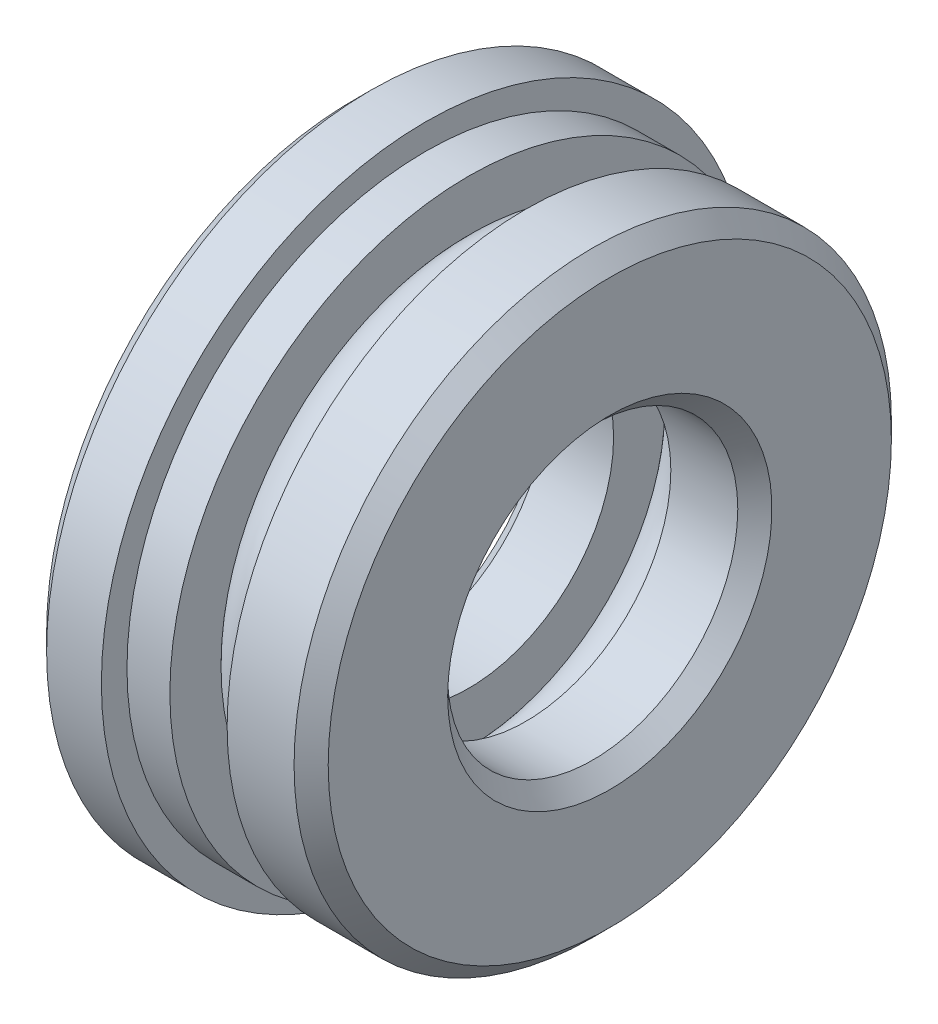
ISO-10303-21;
HEADER;
FILE_DESCRIPTION(('STEP AP214'),'2;1');
FILE_NAME('part.step','',(''),(''),'','','');
FILE_SCHEMA(('AUTOMOTIVE_DESIGN { 1 0 10303 214 1 1 1 1 }'));
ENDSEC;
DATA;
#1=APPLICATION_CONTEXT('core data for automotive mechanical design processes');
#2=APPLICATION_PROTOCOL_DEFINITION('international standard','automotive_design',2000,#1);
#3=PRODUCT_CONTEXT('',#1,'mechanical');
#4=PRODUCT('Part','Part','',(#3));
#5=PRODUCT_RELATED_PRODUCT_CATEGORY('part','',(#4));
#6=PRODUCT_DEFINITION_FORMATION('','',#4);
#7=PRODUCT_DEFINITION_CONTEXT('part definition',#1,'design');
#8=PRODUCT_DEFINITION('design','',#6,#7);
#9=PRODUCT_DEFINITION_SHAPE('','',#8);
#10=(LENGTH_UNIT() NAMED_UNIT(*) SI_UNIT(.MILLI.,.METRE.));
#11=(NAMED_UNIT(*) PLANE_ANGLE_UNIT() SI_UNIT($,.RADIAN.));
#12=(NAMED_UNIT(*) SI_UNIT($,.STERADIAN.) SOLID_ANGLE_UNIT());
#13=UNCERTAINTY_MEASURE_WITH_UNIT(LENGTH_MEASURE(1.E-05),#10,'distance_accuracy_value','');
#14=(GEOMETRIC_REPRESENTATION_CONTEXT(3) GLOBAL_UNCERTAINTY_ASSIGNED_CONTEXT((#13)) GLOBAL_UNIT_ASSIGNED_CONTEXT((#10,
#11,#12)) REPRESENTATION_CONTEXT('',''));
#15=CARTESIAN_POINT('',(0.,0.,0.));
#16=DIRECTION('',(0.,0.,1.));
#17=DIRECTION('',(1.,0.,0.));
#18=AXIS2_PLACEMENT_3D('',#15,#16,#17);
#19=CARTESIAN_POINT('',(8.4,-0.0133040110590031,0.));
#20=DIRECTION('',(-1.,0.,0.));
#21=DIRECTION('',(0.,0.,1.));
#22=AXIS2_PLACEMENT_3D('',#19,#20,#21);
#23=TOROIDAL_SURFACE('',#22,13.,2.25);
#24=CARTESIAN_POINT('',(10.0770509831248,-0.0133040110590031,0.));
#25=DIRECTION('',(-1.,0.,0.));
#26=DIRECTION('',(0.,0.,1.));
#27=AXIS2_PLACEMENT_3D('',#24,#25,#26);
#28=CIRCLE('',#27,11.5);
#29=CARTESIAN_POINT('',(10.0770509831248,-0.0133040110590031,11.5));
#30=VERTEX_POINT('',#29);
#31=EDGE_CURVE('E11',#30,#30,#28,.T.);
#32=ORIENTED_EDGE('',*,*,#31,.F.);
#33=EDGE_LOOP('',(#32));
#34=FACE_BOUND('',#33,.T.);
#35=CARTESIAN_POINT('',(10.0770509831248,-0.0133040110590031,0.));
#36=DIRECTION('',(-1.,0.,0.));
#37=DIRECTION('',(0.,0.,1.));
#38=AXIS2_PLACEMENT_3D('',#35,#36,#37);
#39=CIRCLE('',#38,14.5);
#40=CARTESIAN_POINT('',(10.0770509831248,-0.0133040110590031,14.5));
#41=VERTEX_POINT('',#40);
#42=EDGE_CURVE('E81',#41,#41,#39,.T.);
#43=ORIENTED_EDGE('',*,*,#42,.T.);
#44=EDGE_LOOP('',(#43));
#45=FACE_BOUND('',#44,.T.);
#46=ADVANCED_FACE('F44',(#34,#45),#23,.F.);
#47=CARTESIAN_POINT('',(10.0770509831248,11.486695988941,0.));
#48=DIRECTION('',(1.,0.,0.));
#49=DIRECTION('',(0.,0.,-1.));
#50=AXIS2_PLACEMENT_3D('',#47,#48,#49);
#51=PLANE('',#50);
#52=CARTESIAN_POINT('',(10.0770509831248,-0.0133040110590031,0.));
#53=DIRECTION('',(-1.,0.,0.));
#54=DIRECTION('',(0.,0.,1.));
#55=AXIS2_PLACEMENT_3D('',#52,#53,#54);
#56=CIRCLE('',#55,8.5);
#57=CARTESIAN_POINT('',(10.0770509831248,-0.0133040110590031,8.5));
#58=VERTEX_POINT('',#57);
#59=EDGE_CURVE('E51',#58,#58,#56,.T.);
#60=ORIENTED_EDGE('',*,*,#59,.F.);
#61=EDGE_LOOP('',(#60));
#62=FACE_BOUND('',#61,.T.);
#63=ORIENTED_EDGE('',*,*,#31,.T.);
#64=EDGE_LOOP('',(#63));
#65=FACE_BOUND('',#64,.T.);
#66=ADVANCED_FACE('F119',(#62,#65),#51,.F.);
#67=CARTESIAN_POINT('',(1.80000000000001,-0.0133040110590031,0.));
#68=DIRECTION('',(-1.,0.,0.));
#69=DIRECTION('',(0.,0.,1.));
#70=AXIS2_PLACEMENT_3D('',#67,#68,#69);
#71=CYLINDRICAL_SURFACE('',#70,8.5);
#72=CARTESIAN_POINT('',(14.,-0.0133040110590031,0.));
#73=DIRECTION('',(-1.,0.,0.));
#74=DIRECTION('',(0.,0.,1.));
#75=AXIS2_PLACEMENT_3D('',#72,#73,#74);
#76=CIRCLE('',#75,8.5);
#77=CARTESIAN_POINT('',(14.,-0.0133040110590031,8.5));
#78=VERTEX_POINT('',#77);
#79=EDGE_CURVE('E59',#78,#78,#76,.T.);
#80=ORIENTED_EDGE('',*,*,#79,.F.);
#81=EDGE_LOOP('',(#80));
#82=FACE_BOUND('',#81,.T.);
#83=ORIENTED_EDGE('',*,*,#59,.T.);
#84=EDGE_LOOP('',(#83));
#85=FACE_BOUND('',#84,.T.);
#86=ADVANCED_FACE('F114',(#82,#85),#71,.F.);
#87=CARTESIAN_POINT('',(14.,-0.0133040110590031,0.));
#88=DIRECTION('',(1.,0.,0.));
#89=DIRECTION('',(0.,0.,-1.));
#90=AXIS2_PLACEMENT_3D('',#87,#88,#89);
#91=CONICAL_SURFACE('',#90,8.5,0.785398163397448);
#92=CARTESIAN_POINT('',(15.,-0.0133040110590031,0.));
#93=DIRECTION('',(-1.,0.,0.));
#94=DIRECTION('',(0.,0.,1.));
#95=AXIS2_PLACEMENT_3D('',#92,#93,#94);
#96=CIRCLE('',#95,9.50000000000002);
#97=CARTESIAN_POINT('',(15.,-0.0133040110590031,9.50000000000002));
#98=VERTEX_POINT('',#97);
#99=EDGE_CURVE('E65',#98,#98,#96,.T.);
#100=ORIENTED_EDGE('',*,*,#99,.F.);
#101=EDGE_LOOP('',(#100));
#102=FACE_BOUND('',#101,.T.);
#103=ORIENTED_EDGE('',*,*,#79,.T.);
#104=EDGE_LOOP('',(#103));
#105=FACE_BOUND('',#104,.T.);
#106=ADVANCED_FACE('F108',(#102,#105),#91,.F.);
#107=CARTESIAN_POINT('',(15.,9.48669598894101,0.));
#108=DIRECTION('',(-1.,0.,0.));
#109=DIRECTION('',(0.,0.,1.));
#110=AXIS2_PLACEMENT_3D('',#107,#108,#109);
#111=PLANE('',#110);
#112=CARTESIAN_POINT('',(15.,-0.0133040110590031,0.));
#113=DIRECTION('',(-1.,0.,0.));
#114=DIRECTION('',(0.,0.,1.));
#115=AXIS2_PLACEMENT_3D('',#112,#113,#114);
#116=CIRCLE('',#115,16.5);
#117=CARTESIAN_POINT('',(15.,-0.0133040110590031,16.5));
#118=VERTEX_POINT('',#117);
#119=EDGE_CURVE('E71',#118,#118,#116,.T.);
#120=ORIENTED_EDGE('',*,*,#119,.F.);
#121=EDGE_LOOP('',(#120));
#122=FACE_BOUND('',#121,.T.);
#123=ORIENTED_EDGE('',*,*,#99,.T.);
#124=EDGE_LOOP('',(#123));
#125=FACE_BOUND('',#124,.T.);
#126=ADVANCED_FACE('F102',(#122,#125),#111,.F.);
#127=CARTESIAN_POINT('',(15.,-0.0133040110590031,0.));
#128=DIRECTION('',(-1.,0.,0.));
#129=DIRECTION('',(0.,0.,1.));
#130=AXIS2_PLACEMENT_3D('',#127,#128,#129);
#131=CONICAL_SURFACE('',#130,16.5,0.785398163397445);
#132=CARTESIAN_POINT('',(14.,-0.0133040110590031,0.));
#133=DIRECTION('',(-1.,0.,0.));
#134=DIRECTION('',(0.,0.,1.));
#135=AXIS2_PLACEMENT_3D('',#132,#133,#134);
#136=CIRCLE('',#135,17.5);
#137=CARTESIAN_POINT('',(14.,-0.0133040110590031,17.5));
#138=VERTEX_POINT('',#137);
#139=EDGE_CURVE('E74',#138,#138,#136,.T.);
#140=ORIENTED_EDGE('',*,*,#139,.F.);
#141=EDGE_LOOP('',(#140));
#142=FACE_BOUND('',#141,.T.);
#143=ORIENTED_EDGE('',*,*,#119,.T.);
#144=EDGE_LOOP('',(#143));
#145=FACE_BOUND('',#144,.T.);
#146=ADVANCED_FACE('F96',(#142,#145),#131,.T.);
#147=CARTESIAN_POINT('',(1.80000000000001,-0.0133040110590031,0.));
#148=DIRECTION('',(-1.,0.,0.));
#149=DIRECTION('',(0.,0.,1.));
#150=AXIS2_PLACEMENT_3D('',#147,#148,#149);
#151=CYLINDRICAL_SURFACE('',#150,17.5);
#152=CARTESIAN_POINT('',(10.0770509831248,-0.0133040110590031,0.));
#153=DIRECTION('',(-1.,0.,0.));
#154=DIRECTION('',(0.,0.,1.));
#155=AXIS2_PLACEMENT_3D('',#152,#153,#154);
#156=CIRCLE('',#155,17.5);
#157=CARTESIAN_POINT('',(10.0770509831248,-0.0133040110590031,17.5));
#158=VERTEX_POINT('',#157);
#159=EDGE_CURVE('E77',#158,#158,#156,.T.);
#160=ORIENTED_EDGE('',*,*,#159,.F.);
#161=EDGE_LOOP('',(#160));
#162=FACE_BOUND('',#161,.T.);
#163=ORIENTED_EDGE('',*,*,#139,.T.);
#164=EDGE_LOOP('',(#163));
#165=FACE_BOUND('',#164,.T.);
#166=ADVANCED_FACE('F90',(#162,#165),#151,.T.);
#167=CARTESIAN_POINT('',(10.0770509831248,14.486695988941,0.));
#168=DIRECTION('',(1.,0.,0.));
#169=DIRECTION('',(0.,0.,-1.));
#170=AXIS2_PLACEMENT_3D('',#167,#168,#169);
#171=PLANE('',#170);
#172=ORIENTED_EDGE('',*,*,#42,.F.);
#173=EDGE_LOOP('',(#172));
#174=FACE_BOUND('',#173,.T.);
#175=ORIENTED_EDGE('',*,*,#159,.T.);
#176=EDGE_LOOP('',(#175));
#177=FACE_BOUND('',#176,.T.);
#178=ADVANCED_FACE('F87',(#174,#177),#171,.F.);
#179=CLOSED_SHELL('',(#46,#66,#86,#106,#126,#146,#166,#178));
#180=MANIFOLD_SOLID_BREP('B2',#179);
#181=CARTESIAN_POINT('',(8.4,-0.0133040110590031,0.));
#182=DIRECTION('',(-1.,0.,0.));
#183=DIRECTION('',(0.,0.,1.));
#184=AXIS2_PLACEMENT_3D('',#181,#182,#183);
#185=TOROIDAL_SURFACE('',#184,13.,2.25);
#186=CARTESIAN_POINT('',(8.4,-0.0133040110590031,15.25));
#187=VERTEX_POINT('',#186);
#188=VERTEX_LOOP('',#187);
#189=FACE_BOUND('',#188,.T.);
#190=ADVANCED_FACE('F194',(#189),#185,.T.);
#191=CLOSED_SHELL('',(#190));
#192=MANIFOLD_SOLID_BREP('B6',#191);
#193=CARTESIAN_POINT('',(31.,-0.0133040110590031,0.));
#194=DIRECTION('',(-1.,0.,0.));
#195=DIRECTION('',(0.,1.,0.));
#196=AXIS2_PLACEMENT_3D('',#193,#194,#195);
#197=SPHERICAL_SURFACE('',#196,32.);
#198=CARTESIAN_POINT('',(1.80000000000001,-0.0133040110590031,0.));
#199=DIRECTION('',(-1.,0.,0.));
#200=DIRECTION('',(0.,0.,1.));
#201=AXIS2_PLACEMENT_3D('',#198,#199,#200);
#202=CIRCLE('',#201,13.0904545375629);
#203=CARTESIAN_POINT('',(1.80000000000001,13.0771505265039,0.));
#204=VERTEX_POINT('',#203);
#205=EDGE_CURVE('E193',#204,#204,#202,.T.);
#206=CARTESIAN_POINT('',(4.20914335076239,-0.0133040110590031,0.));
#207=DIRECTION('',(-1.,0.,0.));
#208=DIRECTION('',(0.,0.,1.));
#209=AXIS2_PLACEMENT_3D('',#206,#207,#208);
#210=CIRCLE('',#209,17.5);
#211=CARTESIAN_POINT('',(4.20914335076239,17.486695988941,0.));
#212=VERTEX_POINT('',#211);
#213=EDGE_CURVE('E245',#212,#212,#210,.T.);
#214=CARTESIAN_POINT('',(1.80000000000001,13.0771505265039,0.));
#215=CARTESIAN_POINT('',(1.8214335796401,13.124960979485,0.));
#216=CARTESIAN_POINT('',(1.84298458452997,13.1727187903362,0.));
#217=CARTESIAN_POINT('',(1.88632092036724,13.2681279775024,0.));
#218=CARTESIAN_POINT('',(1.90810625131463,13.3157793538175,0.));
#219=CARTESIAN_POINT('',(1.95191071482488,13.4109745216357,0.));
#220=CARTESIAN_POINT('',(1.97392984738773,13.4585183131388,0.));
#221=CARTESIAN_POINT('',(2.01820138253074,13.5534971643409,0.));
#222=CARTESIAN_POINT('',(2.0404537851109,13.60093222404,0.));
#223=CARTESIAN_POINT('',(2.08519132346794,13.6956924670813,0.));
#224=CARTESIAN_POINT('',(2.10767645924481,13.7430176504234,0.));
#225=CARTESIAN_POINT('',(2.15287892145055,13.8375569988984,0.));
#226=CARTESIAN_POINT('',(2.1755962478794,13.8847711640312,0.));
#227=CARTESIAN_POINT('',(2.22126254327121,13.9790873369005,0.));
#228=CARTESIAN_POINT('',(2.24421151223416,14.0261893446369,0.));
#229=CARTESIAN_POINT('',(2.29034053897936,14.1202800662361,0.));
#230=CARTESIAN_POINT('',(2.31352059676162,14.1672687800989,0.));
#231=CARTESIAN_POINT('',(2.36011124185704,14.261131780206,0.));
#232=CARTESIAN_POINT('',(2.38352182917021,14.3080060664504,0.));
#233=CARTESIAN_POINT('',(2.43057296847626,14.4016390803371,0.));
#234=CARTESIAN_POINT('',(2.45421352046915,14.4483978079796,0.));
#235=CARTESIAN_POINT('',(2.50172401873504,14.541798576467,0.));
#236=CARTESIAN_POINT('',(2.52559396500803,14.588440617312,0.));
#237=CARTESIAN_POINT('',(2.57356267589963,14.6816068868248,0.));
#238=CARTESIAN_POINT('',(2.59766144051824,14.7281311154924,0.));
#239=CARTESIAN_POINT('',(2.64608720664564,14.821060638113,0.));
#240=CARTESIAN_POINT('',(2.67041420815444,14.867465932066,0.));
#241=CARTESIAN_POINT('',(2.7192958610999,14.9601564655893,0.));
#242=CARTESIAN_POINT('',(2.74385051253657,15.0064417051597,0.));
#243=CARTESIAN_POINT('',(2.79318687288271,15.0988910131469,0.));
#244=CARTESIAN_POINT('',(2.81796858179219,15.1450550815637,0.));
#245=CARTESIAN_POINT('',(2.86775845915044,15.2372609333963,0.));
#246=CARTESIAN_POINT('',(2.89276662759921,15.283302716812,0.));
#247=CARTESIAN_POINT('',(2.94300882063853,15.3752628877455,0.));
#248=CARTESIAN_POINT('',(2.96824284522908,15.4211812752633,0.));
#249=CARTESIAN_POINT('',(3.01893614170494,15.5128935464811,0.));
#250=CARTESIAN_POINT('',(3.04439541359026,15.5586874301811,0.));
#251=CARTESIAN_POINT('',(3.09553859037392,15.6501495888479,0.));
#252=CARTESIAN_POINT('',(3.12122249527226,15.6958178638147,0.));
#253=CARTESIAN_POINT('',(3.17281431838023,15.7870277031299,0.));
#254=CARTESIAN_POINT('',(3.19872223658987,15.8325692674784,0.));
#255=CARTESIAN_POINT('',(3.25076146121376,15.9235245867295,0.));
#256=CARTESIAN_POINT('',(3.276892767628,15.9689383416321,0.));
#257=CARTESIAN_POINT('',(3.32937813816446,16.0596369462474,0.));
#258=CARTESIAN_POINT('',(3.35573220228667,16.1049217959602,0.));
#259=CARTESIAN_POINT('',(3.40866245236776,16.1953614975622,0.));
#260=CARTESIAN_POINT('',(3.43523863832663,16.2405163494516,0.));
#261=CARTESIAN_POINT('',(3.48861249085032,16.3306949659097,0.));
#262=CARTESIAN_POINT('',(3.51541015741514,16.3757187304785,0.));
#263=CARTESIAN_POINT('',(3.56922632457626,16.4656340859613,0.));
#264=CARTESIAN_POINT('',(3.59624482517256,16.5105256768753,0.));
#265=CARTESIAN_POINT('',(3.65050200849337,16.6001756019038,0.));
#266=CARTESIAN_POINT('',(3.67774069121789,16.6449339360183,0.));
#267=CARTESIAN_POINT('',(3.73243758158123,16.7343162675167,0.));
#268=CARTESIAN_POINT('',(3.75989578922007,16.7789402649007,0.));
#269=CARTESIAN_POINT('',(3.81503106689425,16.8680528462532,0.));
#270=CARTESIAN_POINT('',(3.84270813692961,16.9125414302218,0.));
#271=CARTESIAN_POINT('',(3.89828047162521,17.0013821113086,0.));
#272=CARTESIAN_POINT('',(3.92617573628545,17.0457342084268,0.));
#273=CARTESIAN_POINT('',(3.98218378709425,17.1343008457357,0.));
#274=CARTESIAN_POINT('',(4.01029657324282,17.1785153859264,0.));
#275=CARTESIAN_POINT('',(4.06673898901778,17.2668058423803,0.));
#276=CARTESIAN_POINT('',(4.09506861864419,17.3108817586435,0.));
#277=CARTESIAN_POINT('',(4.15194403673487,17.3988939044901,0.));
#278=CARTESIAN_POINT('',(4.18048982519915,17.4428301340736,0.));
#279=CARTESIAN_POINT('',(4.20914335076239,17.486695988941,0.));
#280=B_SPLINE_CURVE_WITH_KNOTS('',3,(#214,#215,#216,#217,#218,#219,#220,#221,#222,#223,#224,
#225,#226,#227,#228,#229,#230,#231,#232,#233,#234,#235,#236,#237,#238,#239,#240,#241,#242,#243,
#244,#245,#246,#247,#248,#249,#250,#251,#252,#253,#254,#255,#256,#257,#258,#259,#260,#261,#262,
#263,#264,#265,#266,#267,#268,#269,#270,#271,#272,#273,#274,#275,#276,#277,#278,#279),
.UNSPECIFIED.,.F.,.F.,(4,2,2,2,2,2,2,2,2,2,2,2,2,2,2,2,2,2,2,2,2,2,2,2,2,2,2,2,2,2,2,2,4),(0.,
0.157184891357785,0.314369782715567,0.471554674073345,0.628739565431128,0.785924456788912,
0.943109348146689,1.10029423950447,1.25747913086226,1.41466402222004,1.57184891357782,
1.7290338049356,1.88621869629339,2.04340358765117,2.20058847900894,2.35777337036673,
2.51495826172451,2.67214315308229,2.82932804444008,2.98651293579786,3.14369782715564,
3.30088271851342,3.4580676098712,3.61525250122898,3.77243739258677,3.92962228394455,
4.08680717530233,4.24399206666011,4.40117695801789,4.55836184937568,4.71554674073345,
4.87273163209124,5.02991652344902),.UNSPECIFIED.);
#281=EDGE_CURVE('BSEAM214',#204,#212,#280,.T.);
#282=ORIENTED_EDGE('',*,*,#205,.F.);
#283=ORIENTED_EDGE('',*,*,#213,.T.);
#284=ORIENTED_EDGE('',*,*,#281,.T.);
#285=ORIENTED_EDGE('',*,*,#281,.F.);
#286=EDGE_LOOP('',(#282,#284,#283,#285));
#287=FACE_BOUND('',#286,.T.);
#288=ADVANCED_FACE('F214',(#287),#197,.T.);
#289=CARTESIAN_POINT('',(1.80000000000001,9.48669598894099,0.));
#290=DIRECTION('',(1.,0.,0.));
#291=DIRECTION('',(0.,0.,-1.));
#292=AXIS2_PLACEMENT_3D('',#289,#290,#291);
#293=PLANE('',#292);
#294=CARTESIAN_POINT('',(1.80000000000001,-0.0133040110590031,0.));
#295=DIRECTION('',(-1.,0.,0.));
#296=DIRECTION('',(0.,0.,1.));
#297=AXIS2_PLACEMENT_3D('',#294,#295,#296);
#298=CIRCLE('',#297,9.49999999999999);
#299=CARTESIAN_POINT('',(1.80000000000001,-0.0133040110590031,9.49999999999999));
#300=VERTEX_POINT('',#299);
#301=EDGE_CURVE('E220',#300,#300,#298,.T.);
#302=ORIENTED_EDGE('',*,*,#301,.F.);
#303=EDGE_LOOP('',(#302));
#304=FACE_BOUND('',#303,.T.);
#305=ORIENTED_EDGE('',*,*,#205,.T.);
#306=EDGE_LOOP('',(#305));
#307=FACE_BOUND('',#306,.T.);
#308=ADVANCED_FACE('F284',(#304,#307),#293,.F.);
#309=CARTESIAN_POINT('',(1.80000000000001,-0.0133040110590031,0.));
#310=DIRECTION('',(-1.,0.,0.));
#311=DIRECTION('',(0.,0.,1.));
#312=AXIS2_PLACEMENT_3D('',#309,#310,#311);
#313=CONICAL_SURFACE('',#312,9.49999999999999,0.785398163397448);
#314=CARTESIAN_POINT('',(2.8,-0.0133040110590031,0.));
#315=DIRECTION('',(-1.,0.,0.));
#316=DIRECTION('',(0.,0.,1.));
#317=AXIS2_PLACEMENT_3D('',#314,#315,#316);
#318=CIRCLE('',#317,8.5);
#319=CARTESIAN_POINT('',(2.8,-0.0133040110590031,8.5));
#320=VERTEX_POINT('',#319);
#321=EDGE_CURVE('E224',#320,#320,#318,.T.);
#322=ORIENTED_EDGE('',*,*,#321,.F.);
#323=EDGE_LOOP('',(#322));
#324=FACE_BOUND('',#323,.T.);
#325=ORIENTED_EDGE('',*,*,#301,.T.);
#326=EDGE_LOOP('',(#325));
#327=FACE_BOUND('',#326,.T.);
#328=ADVANCED_FACE('F279',(#324,#327),#313,.F.);
#329=CARTESIAN_POINT('',(1.80000000000001,-0.0133040110590031,0.));
#330=DIRECTION('',(-1.,0.,0.));
#331=DIRECTION('',(0.,0.,1.));
#332=AXIS2_PLACEMENT_3D('',#329,#330,#331);
#333=CYLINDRICAL_SURFACE('',#332,8.5);
#334=CARTESIAN_POINT('',(6.72294901687516,-0.0133040110590031,0.));
#335=DIRECTION('',(-1.,0.,0.));
#336=DIRECTION('',(0.,0.,1.));
#337=AXIS2_PLACEMENT_3D('',#334,#335,#336);
#338=CIRCLE('',#337,8.5);
#339=CARTESIAN_POINT('',(6.72294901687516,-0.0133040110590031,8.5));
#340=VERTEX_POINT('',#339);
#341=EDGE_CURVE('E229',#340,#340,#338,.T.);
#342=ORIENTED_EDGE('',*,*,#341,.F.);
#343=EDGE_LOOP('',(#342));
#344=FACE_BOUND('',#343,.T.);
#345=ORIENTED_EDGE('',*,*,#321,.T.);
#346=EDGE_LOOP('',(#345));
#347=FACE_BOUND('',#346,.T.);
#348=ADVANCED_FACE('F273',(#344,#347),#333,.F.);
#349=CARTESIAN_POINT('',(6.72294901687516,11.486695988941,0.));
#350=DIRECTION('',(-1.,0.,0.));
#351=DIRECTION('',(0.,0.,1.));
#352=AXIS2_PLACEMENT_3D('',#349,#350,#351);
#353=PLANE('',#352);
#354=CARTESIAN_POINT('',(6.72294901687516,-0.0133040110590031,0.));
#355=DIRECTION('',(-1.,0.,0.));
#356=DIRECTION('',(0.,0.,1.));
#357=AXIS2_PLACEMENT_3D('',#354,#355,#356);
#358=CIRCLE('',#357,11.5);
#359=CARTESIAN_POINT('',(6.72294901687516,-0.0133040110590031,11.5));
#360=VERTEX_POINT('',#359);
#361=EDGE_CURVE('E234',#360,#360,#358,.T.);
#362=ORIENTED_EDGE('',*,*,#361,.F.);
#363=EDGE_LOOP('',(#362));
#364=FACE_BOUND('',#363,.T.);
#365=ORIENTED_EDGE('',*,*,#341,.T.);
#366=EDGE_LOOP('',(#365));
#367=FACE_BOUND('',#366,.T.);
#368=ADVANCED_FACE('F267',(#364,#367),#353,.F.);
#369=CARTESIAN_POINT('',(8.4,-0.0133040110590031,0.));
#370=DIRECTION('',(-1.,0.,0.));
#371=DIRECTION('',(0.,0.,1.));
#372=AXIS2_PLACEMENT_3D('',#369,#370,#371);
#373=TOROIDAL_SURFACE('',#372,13.,2.25);
#374=CARTESIAN_POINT('',(6.72294901687516,-0.0133040110590031,0.));
#375=DIRECTION('',(-1.,0.,0.));
#376=DIRECTION('',(0.,0.,1.));
#377=AXIS2_PLACEMENT_3D('',#374,#375,#376);
#378=CIRCLE('',#377,14.5);
#379=CARTESIAN_POINT('',(6.72294901687516,-0.0133040110590031,14.5));
#380=VERTEX_POINT('',#379);
#381=EDGE_CURVE('E238',#380,#380,#378,.T.);
#382=ORIENTED_EDGE('',*,*,#381,.F.);
#383=EDGE_LOOP('',(#382));
#384=FACE_BOUND('',#383,.T.);
#385=ORIENTED_EDGE('',*,*,#361,.T.);
#386=EDGE_LOOP('',(#385));
#387=FACE_BOUND('',#386,.T.);
#388=ADVANCED_FACE('F261',(#384,#387),#373,.F.);
#389=CARTESIAN_POINT('',(6.72294901687516,14.486695988941,0.));
#390=DIRECTION('',(-1.,0.,0.));
#391=DIRECTION('',(0.,0.,1.));
#392=AXIS2_PLACEMENT_3D('',#389,#390,#391);
#393=PLANE('',#392);
#394=CARTESIAN_POINT('',(6.72294901687516,-0.0133040110590031,0.));
#395=DIRECTION('',(-1.,0.,0.));
#396=DIRECTION('',(0.,0.,1.));
#397=AXIS2_PLACEMENT_3D('',#394,#395,#396);
#398=CIRCLE('',#397,17.5);
#399=CARTESIAN_POINT('',(6.72294901687516,-0.0133040110590031,17.5));
#400=VERTEX_POINT('',#399);
#401=EDGE_CURVE('E241',#400,#400,#398,.T.);
#402=ORIENTED_EDGE('',*,*,#401,.F.);
#403=EDGE_LOOP('',(#402));
#404=FACE_BOUND('',#403,.T.);
#405=ORIENTED_EDGE('',*,*,#381,.T.);
#406=EDGE_LOOP('',(#405));
#407=FACE_BOUND('',#406,.T.);
#408=ADVANCED_FACE('F255',(#404,#407),#393,.F.);
#409=CARTESIAN_POINT('',(1.80000000000001,-0.0133040110590031,0.));
#410=DIRECTION('',(-1.,0.,0.));
#411=DIRECTION('',(0.,0.,1.));
#412=AXIS2_PLACEMENT_3D('',#409,#410,#411);
#413=CYLINDRICAL_SURFACE('',#412,17.5);
#414=ORIENTED_EDGE('',*,*,#213,.F.);
#415=EDGE_LOOP('',(#414));
#416=FACE_BOUND('',#415,.T.);
#417=ORIENTED_EDGE('',*,*,#401,.T.);
#418=EDGE_LOOP('',(#417));
#419=FACE_BOUND('',#418,.T.);
#420=ADVANCED_FACE('F252',(#416,#419),#413,.T.);
#421=CLOSED_SHELL('',(#288,#308,#328,#348,#368,#388,#408,#420));
#422=MANIFOLD_SOLID_BREP('B40',#421);
#423=CARTESIAN_POINT('',(31.,-0.0133040110590031,0.));
#424=DIRECTION('',(-1.,0.,0.));
#425=DIRECTION('',(0.,1.,0.));
#426=AXIS2_PLACEMENT_3D('',#423,#424,#425);
#427=SPHERICAL_SURFACE('',#426,32.);
#428=CARTESIAN_POINT('',(4.20914335076239,-0.0133040110590031,0.));
#429=DIRECTION('',(-1.,0.,0.));
#430=DIRECTION('',(0.,0.,1.));
#431=AXIS2_PLACEMENT_3D('',#428,#429,#430);
#432=CIRCLE('',#431,17.5);
#433=CARTESIAN_POINT('',(4.20914335076239,17.486695988941,0.));
#434=VERTEX_POINT('',#433);
#435=EDGE_CURVE('E213',#434,#434,#432,.T.);
#436=CARTESIAN_POINT('',(1.80000000000001,-0.0133040110590031,0.));
#437=DIRECTION('',(-1.,0.,0.));
#438=DIRECTION('',(0.,0.,1.));
#439=AXIS2_PLACEMENT_3D('',#436,#437,#438);
#440=CIRCLE('',#439,13.0904545375629);
#441=CARTESIAN_POINT('',(1.80000000000001,13.0771505265039,0.));
#442=VERTEX_POINT('',#441);
#443=EDGE_CURVE('E372',#442,#442,#440,.T.);
#444=CARTESIAN_POINT('',(4.20914335076239,17.486695988941,0.));
#445=CARTESIAN_POINT('',(4.18048982519915,17.4428301340736,0.));
#446=CARTESIAN_POINT('',(4.15194403673487,17.3988939044901,0.));
#447=CARTESIAN_POINT('',(4.09506861864419,17.3108817586435,0.));
#448=CARTESIAN_POINT('',(4.06673898901778,17.2668058423803,0.));
#449=CARTESIAN_POINT('',(4.01029657324282,17.1785153859264,0.));
#450=CARTESIAN_POINT('',(3.98218378709425,17.1343008457357,0.));
#451=CARTESIAN_POINT('',(3.92617573628545,17.0457342084268,0.));
#452=CARTESIAN_POINT('',(3.89828047162521,17.0013821113086,0.));
#453=CARTESIAN_POINT('',(3.84270813692961,16.9125414302218,0.));
#454=CARTESIAN_POINT('',(3.81503106689425,16.8680528462532,0.));
#455=CARTESIAN_POINT('',(3.75989578922007,16.7789402649007,0.));
#456=CARTESIAN_POINT('',(3.73243758158123,16.7343162675167,0.));
#457=CARTESIAN_POINT('',(3.67774069121789,16.6449339360183,0.));
#458=CARTESIAN_POINT('',(3.65050200849337,16.6001756019038,0.));
#459=CARTESIAN_POINT('',(3.59624482517256,16.5105256768753,0.));
#460=CARTESIAN_POINT('',(3.56922632457626,16.4656340859613,0.));
#461=CARTESIAN_POINT('',(3.51541015741514,16.3757187304785,0.));
#462=CARTESIAN_POINT('',(3.48861249085032,16.3306949659097,0.));
#463=CARTESIAN_POINT('',(3.43523863832663,16.2405163494516,0.));
#464=CARTESIAN_POINT('',(3.40866245236776,16.1953614975622,0.));
#465=CARTESIAN_POINT('',(3.35573220228667,16.1049217959602,0.));
#466=CARTESIAN_POINT('',(3.32937813816446,16.0596369462474,0.));
#467=CARTESIAN_POINT('',(3.276892767628,15.9689383416321,0.));
#468=CARTESIAN_POINT('',(3.25076146121376,15.9235245867295,0.));
#469=CARTESIAN_POINT('',(3.19872223658987,15.8325692674784,0.));
#470=CARTESIAN_POINT('',(3.17281431838023,15.7870277031299,0.));
#471=CARTESIAN_POINT('',(3.12122249527226,15.6958178638147,0.));
#472=CARTESIAN_POINT('',(3.09553859037392,15.6501495888479,0.));
#473=CARTESIAN_POINT('',(3.04439541359026,15.5586874301811,0.));
#474=CARTESIAN_POINT('',(3.01893614170494,15.5128935464811,0.));
#475=CARTESIAN_POINT('',(2.96824284522908,15.4211812752633,0.));
#476=CARTESIAN_POINT('',(2.94300882063853,15.3752628877455,0.));
#477=CARTESIAN_POINT('',(2.89276662759921,15.283302716812,0.));
#478=CARTESIAN_POINT('',(2.86775845915044,15.2372609333963,0.));
#479=CARTESIAN_POINT('',(2.81796858179219,15.1450550815637,0.));
#480=CARTESIAN_POINT('',(2.79318687288271,15.0988910131469,0.));
#481=CARTESIAN_POINT('',(2.74385051253657,15.0064417051597,0.));
#482=CARTESIAN_POINT('',(2.7192958610999,14.9601564655893,0.));
#483=CARTESIAN_POINT('',(2.67041420815444,14.867465932066,0.));
#484=CARTESIAN_POINT('',(2.64608720664564,14.821060638113,0.));
#485=CARTESIAN_POINT('',(2.59766144051824,14.7281311154924,0.));
#486=CARTESIAN_POINT('',(2.57356267589963,14.6816068868248,0.));
#487=CARTESIAN_POINT('',(2.52559396500803,14.588440617312,0.));
#488=CARTESIAN_POINT('',(2.50172401873504,14.541798576467,0.));
#489=CARTESIAN_POINT('',(2.45421352046915,14.4483978079796,0.));
#490=CARTESIAN_POINT('',(2.43057296847626,14.4016390803371,0.));
#491=CARTESIAN_POINT('',(2.3835218291702,14.3080060664504,0.));
#492=CARTESIAN_POINT('',(2.36011124185704,14.261131780206,0.));
#493=CARTESIAN_POINT('',(2.31352059676162,14.1672687800989,0.));
#494=CARTESIAN_POINT('',(2.29034053897936,14.1202800662361,0.));
#495=CARTESIAN_POINT('',(2.24421151223416,14.0261893446369,0.));
#496=CARTESIAN_POINT('',(2.22126254327121,13.9790873369005,0.));
#497=CARTESIAN_POINT('',(2.1755962478794,13.8847711640312,0.));
#498=CARTESIAN_POINT('',(2.15287892145055,13.8375569988984,0.));
#499=CARTESIAN_POINT('',(2.10767645924481,13.7430176504234,0.));
#500=CARTESIAN_POINT('',(2.08519132346794,13.6956924670813,0.));
#501=CARTESIAN_POINT('',(2.0404537851109,13.60093222404,0.));
#502=CARTESIAN_POINT('',(2.01820138253074,13.5534971643409,0.));
#503=CARTESIAN_POINT('',(1.97392984738773,13.4585183131388,0.));
#504=CARTESIAN_POINT('',(1.95191071482488,13.4109745216357,0.));
#505=CARTESIAN_POINT('',(1.90810625131463,13.3157793538175,0.));
#506=CARTESIAN_POINT('',(1.88632092036724,13.2681279775024,0.));
#507=CARTESIAN_POINT('',(1.84298458452997,13.1727187903362,0.));
#508=CARTESIAN_POINT('',(1.8214335796401,13.124960979485,0.));
#509=CARTESIAN_POINT('',(1.80000000000001,13.0771505265039,0.));
#510=B_SPLINE_CURVE_WITH_KNOTS('',3,(#444,#445,#446,#447,#448,#449,#450,#451,#452,#453,#454,
#455,#456,#457,#458,#459,#460,#461,#462,#463,#464,#465,#466,#467,#468,#469,#470,#471,#472,#473,
#474,#475,#476,#477,#478,#479,#480,#481,#482,#483,#484,#485,#486,#487,#488,#489,#490,#491,#492,
#493,#494,#495,#496,#497,#498,#499,#500,#501,#502,#503,#504,#505,#506,#507,#508,#509),
.UNSPECIFIED.,.F.,.F.,(4,2,2,2,2,2,2,2,2,2,2,2,2,2,2,2,2,2,2,2,2,2,2,2,2,2,2,2,2,2,2,2,4),(0.,
0.157184891357782,0.314369782715568,0.471554674073344,0.628739565431127,0.785924456788909,
0.943109348146686,1.10029423950447,1.25747913086225,1.41466402222004,1.57184891357782,
1.7290338049356,1.88621869629338,2.04340358765116,2.20058847900894,2.35777337036672,
2.51495826172451,2.67214315308229,2.82932804444008,2.98651293579785,3.14369782715563,
3.30088271851342,3.4580676098712,3.61525250122898,3.77243739258676,3.92962228394455,
4.08680717530233,4.24399206666011,4.40117695801789,4.55836184937567,4.71554674073345,
4.87273163209123,5.02991652344902),.UNSPECIFIED.);
#511=EDGE_CURVE('BSEAM344',#434,#442,#510,.T.);
#512=ORIENTED_EDGE('',*,*,#435,.F.);
#513=ORIENTED_EDGE('',*,*,#443,.T.);
#514=ORIENTED_EDGE('',*,*,#511,.T.);
#515=ORIENTED_EDGE('',*,*,#511,.F.);
#516=EDGE_LOOP('',(#512,#514,#513,#515));
#517=FACE_BOUND('',#516,.T.);
#518=ADVANCED_FACE('F344',(#517),#427,.F.);
#519=CARTESIAN_POINT('',(4.20914335076239,17.486695988941,0.));
#520=DIRECTION('',(-1.,0.,0.));
#521=DIRECTION('',(0.,0.,1.));
#522=AXIS2_PLACEMENT_3D('',#519,#520,#521);
#523=PLANE('',#522);
#524=CARTESIAN_POINT('',(4.20914335076239,-0.0133040110590031,0.));
#525=DIRECTION('',(-1.,0.,0.));
#526=DIRECTION('',(0.,0.,1.));
#527=AXIS2_PLACEMENT_3D('',#524,#525,#526);
#528=CIRCLE('',#527,19.);
#529=CARTESIAN_POINT('',(4.20914335076239,-0.0133040110590031,19.));
#530=VERTEX_POINT('',#529);
#531=EDGE_CURVE('E351',#530,#530,#528,.T.);
#532=ORIENTED_EDGE('',*,*,#531,.F.);
#533=EDGE_LOOP('',(#532));
#534=FACE_BOUND('',#533,.T.);
#535=ORIENTED_EDGE('',*,*,#435,.T.);
#536=EDGE_LOOP('',(#535));
#537=FACE_BOUND('',#536,.T.);
#538=ADVANCED_FACE('F397',(#534,#537),#523,.F.);
#539=CARTESIAN_POINT('',(1.80000000000001,-0.0133040110590031,0.));
#540=DIRECTION('',(-1.,0.,0.));
#541=DIRECTION('',(0.,0.,1.));
#542=AXIS2_PLACEMENT_3D('',#539,#540,#541);
#543=CYLINDRICAL_SURFACE('',#542,19.);
#544=CARTESIAN_POINT('',(1.,-0.0133040110590031,0.));
#545=DIRECTION('',(-1.,0.,0.));
#546=DIRECTION('',(0.,0.,1.));
#547=AXIS2_PLACEMENT_3D('',#544,#545,#546);
#548=CIRCLE('',#547,19.);
#549=CARTESIAN_POINT('',(1.,-0.0133040110590031,19.));
#550=VERTEX_POINT('',#549);
#551=EDGE_CURVE('E358',#550,#550,#548,.T.);
#552=ORIENTED_EDGE('',*,*,#551,.F.);
#553=EDGE_LOOP('',(#552));
#554=FACE_BOUND('',#553,.T.);
#555=ORIENTED_EDGE('',*,*,#531,.T.);
#556=EDGE_LOOP('',(#555));
#557=FACE_BOUND('',#556,.T.);
#558=ADVANCED_FACE('F392',(#554,#557),#543,.T.);
#559=CARTESIAN_POINT('',(1.,-0.0133040110590031,0.));
#560=DIRECTION('',(1.,0.,0.));
#561=DIRECTION('',(0.,0.,-1.));
#562=AXIS2_PLACEMENT_3D('',#559,#560,#561);
#563=CONICAL_SURFACE('',#562,19.,0.785398163397448);
#564=CARTESIAN_POINT('',(0.,-0.0133040110590031,0.));
#565=DIRECTION('',(-1.,0.,0.));
#566=DIRECTION('',(0.,0.,1.));
#567=AXIS2_PLACEMENT_3D('',#564,#565,#566);
#568=CIRCLE('',#567,18.);
#569=CARTESIAN_POINT('',(0.,-0.0133040110590031,18.));
#570=VERTEX_POINT('',#569);
#571=EDGE_CURVE('E364',#570,#570,#568,.T.);
#572=ORIENTED_EDGE('',*,*,#571,.F.);
#573=EDGE_LOOP('',(#572));
#574=FACE_BOUND('',#573,.T.);
#575=ORIENTED_EDGE('',*,*,#551,.T.);
#576=EDGE_LOOP('',(#575));
#577=FACE_BOUND('',#576,.T.);
#578=ADVANCED_FACE('F386',(#574,#577),#563,.T.);
#579=CARTESIAN_POINT('',(0.,17.986695988941,0.));
#580=DIRECTION('',(1.,0.,0.));
#581=DIRECTION('',(0.,0.,-1.));
#582=AXIS2_PLACEMENT_3D('',#579,#580,#581);
#583=PLANE('',#582);
#584=CARTESIAN_POINT('',(0.,-0.0133040110590031,0.));
#585=DIRECTION('',(-1.,0.,0.));
#586=DIRECTION('',(0.,0.,1.));
#587=AXIS2_PLACEMENT_3D('',#584,#585,#586);
#588=CIRCLE('',#587,13.0904545375629);
#589=CARTESIAN_POINT('',(0.,-0.0133040110590031,13.0904545375629));
#590=VERTEX_POINT('',#589);
#591=EDGE_CURVE('E369',#590,#590,#588,.T.);
#592=ORIENTED_EDGE('',*,*,#591,.F.);
#593=EDGE_LOOP('',(#592));
#594=FACE_BOUND('',#593,.T.);
#595=ORIENTED_EDGE('',*,*,#571,.T.);
#596=EDGE_LOOP('',(#595));
#597=FACE_BOUND('',#596,.T.);
#598=ADVANCED_FACE('F380',(#594,#597),#583,.F.);
#599=CARTESIAN_POINT('',(1.80000000000001,-0.0133040110590031,0.));
#600=DIRECTION('',(-1.,0.,0.));
#601=DIRECTION('',(0.,0.,1.));
#602=AXIS2_PLACEMENT_3D('',#599,#600,#601);
#603=CYLINDRICAL_SURFACE('',#602,13.0904545375629);
#604=ORIENTED_EDGE('',*,*,#443,.F.);
#605=EDGE_LOOP('',(#604));
#606=FACE_BOUND('',#605,.T.);
#607=ORIENTED_EDGE('',*,*,#591,.T.);
#608=EDGE_LOOP('',(#607));
#609=FACE_BOUND('',#608,.T.);
#610=ADVANCED_FACE('F377',(#606,#609),#603,.F.);
#611=CLOSED_SHELL('',(#518,#538,#558,#578,#598,#610));
#612=MANIFOLD_SOLID_BREP('B188',#611);
#613=ADVANCED_BREP_SHAPE_REPRESENTATION('',(#18,#180,#192,#422,#612),#14);
#614=SHAPE_DEFINITION_REPRESENTATION(#9,#613);
ENDSEC;
END-ISO-10303-21;
